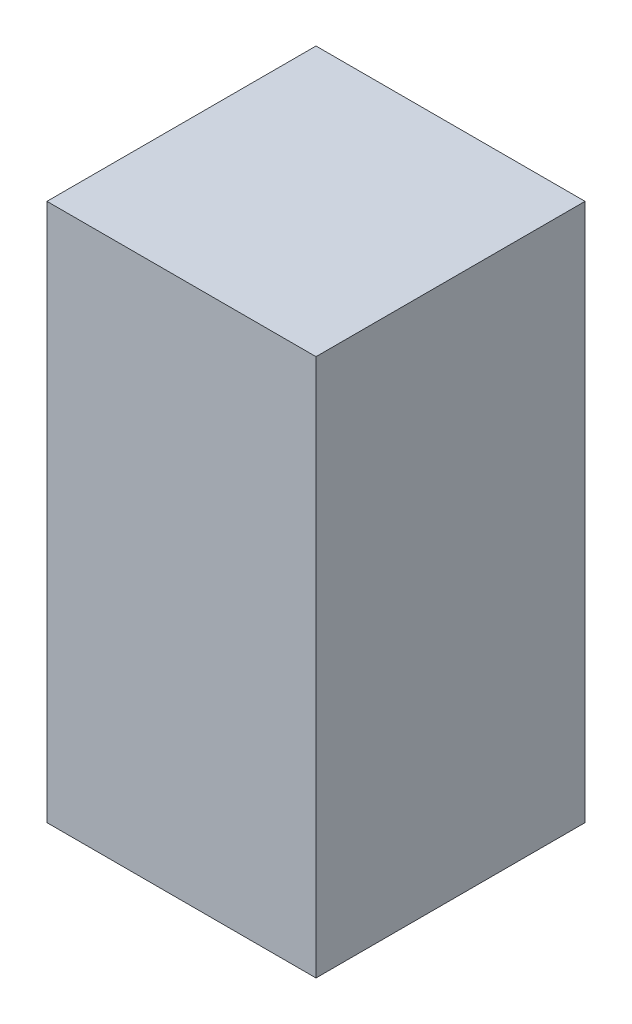
ISO-10303-21;
HEADER;
FILE_DESCRIPTION(('STEP AP214'),'2;1');
FILE_NAME('part.step','',(''),(''),'','','');
FILE_SCHEMA(('AUTOMOTIVE_DESIGN { 1 0 10303 214 1 1 1 1 }'));
ENDSEC;
DATA;
#1=APPLICATION_CONTEXT('core data for automotive mechanical design processes');
#2=APPLICATION_PROTOCOL_DEFINITION('international standard','automotive_design',2000,#1);
#3=PRODUCT_CONTEXT('',#1,'mechanical');
#4=PRODUCT('Part','Part','',(#3));
#5=PRODUCT_RELATED_PRODUCT_CATEGORY('part','',(#4));
#6=PRODUCT_DEFINITION_FORMATION('','',#4);
#7=PRODUCT_DEFINITION_CONTEXT('part definition',#1,'design');
#8=PRODUCT_DEFINITION('design','',#6,#7);
#9=PRODUCT_DEFINITION_SHAPE('','',#8);
#10=(LENGTH_UNIT() NAMED_UNIT(*) SI_UNIT(.MILLI.,.METRE.));
#11=(NAMED_UNIT(*) PLANE_ANGLE_UNIT() SI_UNIT($,.RADIAN.));
#12=(NAMED_UNIT(*) SI_UNIT($,.STERADIAN.) SOLID_ANGLE_UNIT());
#13=UNCERTAINTY_MEASURE_WITH_UNIT(LENGTH_MEASURE(1.E-05),#10,'distance_accuracy_value','');
#14=(GEOMETRIC_REPRESENTATION_CONTEXT(3) GLOBAL_UNCERTAINTY_ASSIGNED_CONTEXT((#13)) GLOBAL_UNIT_ASSIGNED_CONTEXT((#10,
#11,#12)) REPRESENTATION_CONTEXT('',''));
#15=CARTESIAN_POINT('',(0.,0.,0.));
#16=DIRECTION('',(0.,0.,1.));
#17=DIRECTION('',(1.,0.,0.));
#18=AXIS2_PLACEMENT_3D('',#15,#16,#17);
#19=CARTESIAN_POINT('',(3.25,13.,-3.25));
#20=DIRECTION('',(-1.,0.,0.));
#21=DIRECTION('',(0.,0.,1.));
#22=AXIS2_PLACEMENT_3D('',#19,#20,#21);
#23=PLANE('',#22);
#24=DIRECTION('',(0.,0.,-1.));
#25=VECTOR('',#24,1.);
#26=CARTESIAN_POINT('',(3.25,0.,-3.25));
#27=LINE('',#26,#25);
#28=CARTESIAN_POINT('',(3.25,0.,3.25));
#29=VERTEX_POINT('',#28);
#30=CARTESIAN_POINT('',(3.25,0.,-3.25));
#31=VERTEX_POINT('',#30);
#32=EDGE_CURVE('E95',#29,#31,#27,.T.);
#33=ORIENTED_EDGE('',*,*,#32,.T.);
#34=DIRECTION('',(0.,-1.,0.));
#35=VECTOR('',#34,1.);
#36=CARTESIAN_POINT('',(3.25,13.,-3.25));
#37=LINE('',#36,#35);
#38=CARTESIAN_POINT('',(3.25,13.,-3.25));
#39=VERTEX_POINT('',#38);
#40=EDGE_CURVE('E11',#39,#31,#37,.T.);
#41=ORIENTED_EDGE('',*,*,#40,.F.);
#42=DIRECTION('',(0.,0.,-1.));
#43=VECTOR('',#42,1.);
#44=CARTESIAN_POINT('',(3.25,13.,-3.25));
#45=LINE('',#44,#43);
#46=CARTESIAN_POINT('',(3.25,13.,3.25));
#47=VERTEX_POINT('',#46);
#48=EDGE_CURVE('E83',#47,#39,#45,.T.);
#49=ORIENTED_EDGE('',*,*,#48,.F.);
#50=DIRECTION('',(0.,-1.,0.));
#51=VECTOR('',#50,1.);
#52=CARTESIAN_POINT('',(3.25,13.,3.25));
#53=LINE('',#52,#51);
#54=EDGE_CURVE('E91',#47,#29,#53,.T.);
#55=ORIENTED_EDGE('',*,*,#54,.T.);
#56=EDGE_LOOP('',(#33,#41,#49,#55));
#57=FACE_BOUND('',#56,.T.);
#58=ADVANCED_FACE('F32',(#57),#23,.F.);
#59=CARTESIAN_POINT('',(-3.25,13.,-3.25));
#60=DIRECTION('',(0.,0.,1.));
#61=DIRECTION('',(1.,0.,0.));
#62=AXIS2_PLACEMENT_3D('',#59,#60,#61);
#63=PLANE('',#62);
#64=DIRECTION('',(-1.,0.,0.));
#65=VECTOR('',#64,1.);
#66=CARTESIAN_POINT('',(-3.25,0.,-3.25));
#67=LINE('',#66,#65);
#68=CARTESIAN_POINT('',(-3.25,0.,-3.25));
#69=VERTEX_POINT('',#68);
#70=EDGE_CURVE('E87',#31,#69,#67,.T.);
#71=ORIENTED_EDGE('',*,*,#70,.T.);
#72=DIRECTION('',(0.,-1.,0.));
#73=VECTOR('',#72,1.);
#74=CARTESIAN_POINT('',(-3.25,13.,-3.25));
#75=LINE('',#74,#73);
#76=CARTESIAN_POINT('',(-3.25,13.,-3.25));
#77=VERTEX_POINT('',#76);
#78=EDGE_CURVE('E40',#77,#69,#75,.T.);
#79=ORIENTED_EDGE('',*,*,#78,.F.);
#80=DIRECTION('',(-1.,0.,0.));
#81=VECTOR('',#80,1.);
#82=CARTESIAN_POINT('',(-3.25,13.,-3.25));
#83=LINE('',#82,#81);
#84=EDGE_CURVE('E78',#39,#77,#83,.T.);
#85=ORIENTED_EDGE('',*,*,#84,.F.);
#86=ORIENTED_EDGE('',*,*,#40,.T.);
#87=EDGE_LOOP('',(#71,#79,#85,#86));
#88=FACE_BOUND('',#87,.T.);
#89=ADVANCED_FACE('F86',(#88),#63,.F.);
#90=CARTESIAN_POINT('',(-3.25,13.,-3.25));
#91=DIRECTION('',(1.,0.,0.));
#92=DIRECTION('',(0.,0.,-1.));
#93=AXIS2_PLACEMENT_3D('',#90,#91,#92);
#94=PLANE('',#93);
#95=DIRECTION('',(0.,0.,1.));
#96=VECTOR('',#95,1.);
#97=CARTESIAN_POINT('',(-3.25,0.,-3.25));
#98=LINE('',#97,#96);
#99=CARTESIAN_POINT('',(-3.25,0.,3.25));
#100=VERTEX_POINT('',#99);
#101=EDGE_CURVE('E65',#69,#100,#98,.T.);
#102=ORIENTED_EDGE('',*,*,#101,.T.);
#103=DIRECTION('',(0.,-1.,0.));
#104=VECTOR('',#103,1.);
#105=CARTESIAN_POINT('',(-3.25,13.,3.25));
#106=LINE('',#105,#104);
#107=CARTESIAN_POINT('',(-3.25,13.,3.25));
#108=VERTEX_POINT('',#107);
#109=EDGE_CURVE('E88',#108,#100,#106,.T.);
#110=ORIENTED_EDGE('',*,*,#109,.F.);
#111=DIRECTION('',(0.,0.,1.));
#112=VECTOR('',#111,1.);
#113=CARTESIAN_POINT('',(-3.25,13.,-3.25));
#114=LINE('',#113,#112);
#115=EDGE_CURVE('E81',#77,#108,#114,.T.);
#116=ORIENTED_EDGE('',*,*,#115,.F.);
#117=ORIENTED_EDGE('',*,*,#78,.T.);
#118=EDGE_LOOP('',(#102,#110,#116,#117));
#119=FACE_BOUND('',#118,.T.);
#120=ADVANCED_FACE('F89',(#119),#94,.F.);
#121=CARTESIAN_POINT('',(-3.25,13.,3.25));
#122=DIRECTION('',(0.,0.,-1.));
#123=DIRECTION('',(-1.,0.,0.));
#124=AXIS2_PLACEMENT_3D('',#121,#122,#123);
#125=PLANE('',#124);
#126=DIRECTION('',(1.,0.,0.));
#127=VECTOR('',#126,1.);
#128=CARTESIAN_POINT('',(-3.25,0.,3.25));
#129=LINE('',#128,#127);
#130=EDGE_CURVE('E71',#100,#29,#129,.T.);
#131=ORIENTED_EDGE('',*,*,#130,.T.);
#132=ORIENTED_EDGE('',*,*,#54,.F.);
#133=DIRECTION('',(1.,0.,0.));
#134=VECTOR('',#133,1.);
#135=CARTESIAN_POINT('',(-3.25,13.,3.25));
#136=LINE('',#135,#134);
#137=EDGE_CURVE('E48',#108,#47,#136,.T.);
#138=ORIENTED_EDGE('',*,*,#137,.F.);
#139=ORIENTED_EDGE('',*,*,#109,.T.);
#140=EDGE_LOOP('',(#131,#132,#138,#139));
#141=FACE_BOUND('',#140,.T.);
#142=ADVANCED_FACE('F102',(#141),#125,.F.);
#143=CARTESIAN_POINT('',(0.,13.,0.));
#144=DIRECTION('',(0.,1.,0.));
#145=DIRECTION('',(0.,0.,1.));
#146=AXIS2_PLACEMENT_3D('',#143,#144,#145);
#147=PLANE('',#146);
#148=ORIENTED_EDGE('',*,*,#48,.T.);
#149=ORIENTED_EDGE('',*,*,#84,.T.);
#150=ORIENTED_EDGE('',*,*,#115,.T.);
#151=ORIENTED_EDGE('',*,*,#137,.T.);
#152=EDGE_LOOP('',(#148,#149,#150,#151));
#153=FACE_BOUND('',#152,.T.);
#154=ADVANCED_FACE('F79',(#153),#147,.T.);
#155=CARTESIAN_POINT('',(0.,0.,0.));
#156=DIRECTION('',(0.,1.,0.));
#157=DIRECTION('',(0.,0.,1.));
#158=AXIS2_PLACEMENT_3D('',#155,#156,#157);
#159=PLANE('',#158);
#160=ORIENTED_EDGE('',*,*,#32,.F.);
#161=ORIENTED_EDGE('',*,*,#130,.F.);
#162=ORIENTED_EDGE('',*,*,#101,.F.);
#163=ORIENTED_EDGE('',*,*,#70,.F.);
#164=EDGE_LOOP('',(#160,#161,#162,#163));
#165=FACE_BOUND('',#164,.T.);
#166=ADVANCED_FACE('F105',(#165),#159,.F.);
#167=CLOSED_SHELL('',(#58,#89,#120,#142,#154,#166));
#168=MANIFOLD_SOLID_BREP('B2',#167);
#169=ADVANCED_BREP_SHAPE_REPRESENTATION('',(#18,#168),#14);
#170=SHAPE_DEFINITION_REPRESENTATION(#9,#169);
ENDSEC;
END-ISO-10303-21;
